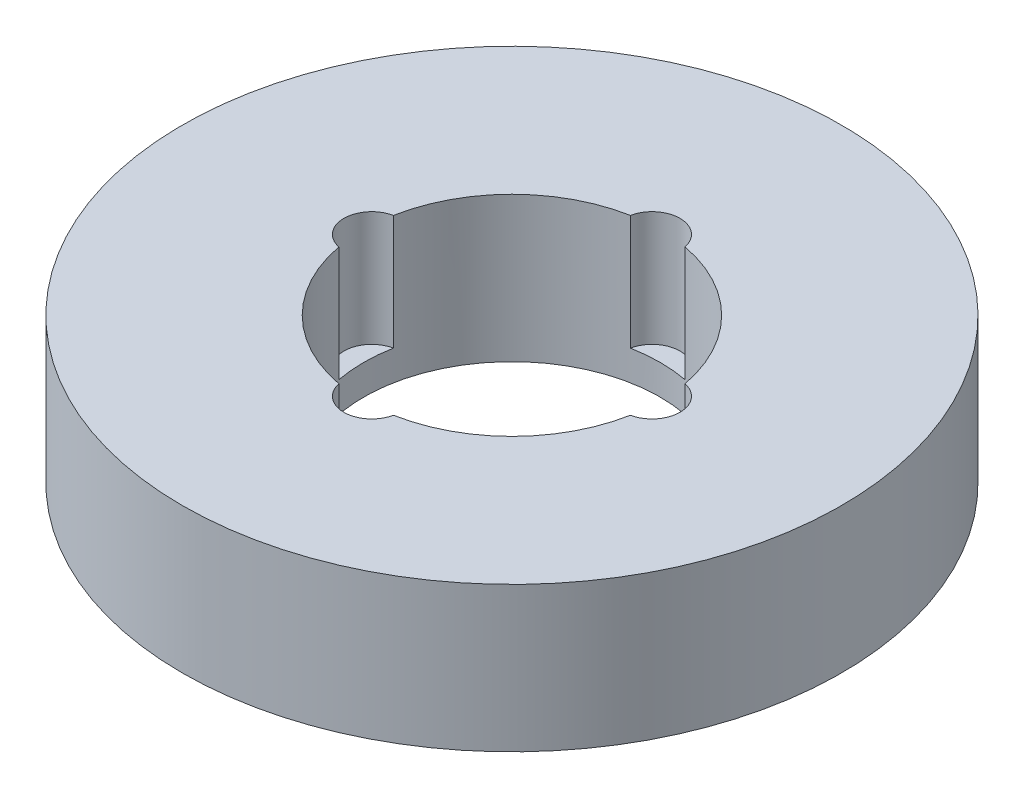
ISO-10303-21;
HEADER;
FILE_DESCRIPTION(('STEP AP214'),'2;1');
FILE_NAME('part.step','',(''),(''),'','','');
FILE_SCHEMA(('AUTOMOTIVE_DESIGN { 1 0 10303 214 1 1 1 1 }'));
ENDSEC;
DATA;
#1=APPLICATION_CONTEXT('core data for automotive mechanical design processes');
#2=APPLICATION_PROTOCOL_DEFINITION('international standard','automotive_design',2000,#1);
#3=PRODUCT_CONTEXT('',#1,'mechanical');
#4=PRODUCT('Part','Part','',(#3));
#5=PRODUCT_RELATED_PRODUCT_CATEGORY('part','',(#4));
#6=PRODUCT_DEFINITION_FORMATION('','',#4);
#7=PRODUCT_DEFINITION_CONTEXT('part definition',#1,'design');
#8=PRODUCT_DEFINITION('design','',#6,#7);
#9=PRODUCT_DEFINITION_SHAPE('','',#8);
#10=(LENGTH_UNIT() NAMED_UNIT(*) SI_UNIT(.MILLI.,.METRE.));
#11=(NAMED_UNIT(*) PLANE_ANGLE_UNIT() SI_UNIT($,.RADIAN.));
#12=(NAMED_UNIT(*) SI_UNIT($,.STERADIAN.) SOLID_ANGLE_UNIT());
#13=UNCERTAINTY_MEASURE_WITH_UNIT(LENGTH_MEASURE(1.E-05),#10,'distance_accuracy_value','');
#14=(GEOMETRIC_REPRESENTATION_CONTEXT(3) GLOBAL_UNCERTAINTY_ASSIGNED_CONTEXT((#13)) GLOBAL_UNIT_ASSIGNED_CONTEXT((#10,
#11,#12)) REPRESENTATION_CONTEXT('',''));
#15=CARTESIAN_POINT('',(0.,0.,0.));
#16=DIRECTION('',(0.,0.,1.));
#17=DIRECTION('',(1.,0.,0.));
#18=AXIS2_PLACEMENT_3D('',#15,#16,#17);
#19=CARTESIAN_POINT('',(0.,22.,0.));
#20=DIRECTION('',(0.,-1.,0.));
#21=DIRECTION('',(0.,0.,-1.));
#22=AXIS2_PLACEMENT_3D('',#19,#20,#21);
#23=CYLINDRICAL_SURFACE('',#22,50.);
#24=CARTESIAN_POINT('',(0.,22.,0.));
#25=DIRECTION('',(0.,1.,0.));
#26=DIRECTION('',(0.,0.,1.));
#27=AXIS2_PLACEMENT_3D('',#24,#25,#26);
#28=CIRCLE('',#27,50.);
#29=CARTESIAN_POINT('',(0.,22.,50.));
#30=VERTEX_POINT('',#29);
#31=EDGE_CURVE('E148',#30,#30,#28,.T.);
#32=ORIENTED_EDGE('',*,*,#31,.F.);
#33=EDGE_LOOP('',(#32));
#34=FACE_BOUND('',#33,.T.);
#35=CARTESIAN_POINT('',(0.,0.,0.));
#36=DIRECTION('',(0.,1.,0.));
#37=DIRECTION('',(0.,0.,1.));
#38=AXIS2_PLACEMENT_3D('',#35,#36,#37);
#39=CIRCLE('',#38,50.);
#40=CARTESIAN_POINT('',(0.,0.,50.));
#41=VERTEX_POINT('',#40);
#42=EDGE_CURVE('E139',#41,#41,#39,.T.);
#43=ORIENTED_EDGE('',*,*,#42,.T.);
#44=EDGE_LOOP('',(#43));
#45=FACE_BOUND('',#44,.T.);
#46=ADVANCED_FACE('F39',(#34,#45),#23,.T.);
#47=CARTESIAN_POINT('',(0.,22.,0.));
#48=DIRECTION('',(0.,1.,0.));
#49=DIRECTION('',(0.,0.,1.));
#50=AXIS2_PLACEMENT_3D('',#47,#48,#49);
#51=PLANE('',#50);
#52=CARTESIAN_POINT('',(0.,22.,21.2632696186375));
#53=DIRECTION('',(0.,1.,0.));
#54=DIRECTION('',(1.,0.,0.));
#55=AXIS2_PLACEMENT_3D('',#52,#53,#54);
#56=CIRCLE('',#55,4.22905657797358);
#57=CARTESIAN_POINT('',(-4.14231598885823,22.,22.1154068072113));
#58=VERTEX_POINT('',#57);
#59=CARTESIAN_POINT('',(4.14231598885839,22.,22.1154068072113));
#60=VERTEX_POINT('',#59);
#61=EDGE_CURVE('E175',#58,#60,#56,.T.);
#62=ORIENTED_EDGE('',*,*,#61,.F.);
#63=CARTESIAN_POINT('',(0.,22.,0.));
#64=DIRECTION('',(0.,1.,0.));
#65=DIRECTION('',(0.,0.,1.));
#66=AXIS2_PLACEMENT_3D('',#63,#64,#65);
#67=CIRCLE('',#66,22.5);
#68=CARTESIAN_POINT('',(-22.1154068072113,22.,4.14231598885831));
#69=VERTEX_POINT('',#68);
#70=EDGE_CURVE('E134',#69,#58,#67,.T.);
#71=ORIENTED_EDGE('',*,*,#70,.F.);
#72=CARTESIAN_POINT('',(-21.2632696186375,22.,0.));
#73=DIRECTION('',(0.,1.,0.));
#74=DIRECTION('',(0.,0.,1.));
#75=AXIS2_PLACEMENT_3D('',#72,#73,#74);
#76=CIRCLE('',#75,4.22905657797358);
#77=CARTESIAN_POINT('',(-22.1154068072113,22.,-4.14231598885831));
#78=VERTEX_POINT('',#77);
#79=EDGE_CURVE('E143',#78,#69,#76,.T.);
#80=ORIENTED_EDGE('',*,*,#79,.F.);
#81=CARTESIAN_POINT('',(-4.14231598885854,22.,-22.1154068072113));
#82=VERTEX_POINT('',#81);
#83=EDGE_CURVE('E123',#82,#78,#67,.T.);
#84=ORIENTED_EDGE('',*,*,#83,.F.);
#85=CARTESIAN_POINT('',(-2.22720927228789E-13,22.,-21.2632696186375));
#86=DIRECTION('',(0.,1.,0.));
#87=DIRECTION('',(-1.,0.,0.));
#88=AXIS2_PLACEMENT_3D('',#85,#86,#87);
#89=CIRCLE('',#88,4.22905657797358);
#90=CARTESIAN_POINT('',(4.14231598885808,22.,-22.1154068072114));
#91=VERTEX_POINT('',#90);
#92=EDGE_CURVE('E106',#91,#82,#89,.T.);
#93=ORIENTED_EDGE('',*,*,#92,.F.);
#94=CARTESIAN_POINT('',(22.1154068072113,22.,-4.14231598885831));
#95=VERTEX_POINT('',#94);
#96=EDGE_CURVE('E125',#95,#91,#67,.T.);
#97=ORIENTED_EDGE('',*,*,#96,.F.);
#98=CARTESIAN_POINT('',(21.2632696186375,22.,0.));
#99=DIRECTION('',(0.,1.,0.));
#100=DIRECTION('',(0.,0.,-1.));
#101=AXIS2_PLACEMENT_3D('',#98,#99,#100);
#102=CIRCLE('',#101,4.22905657797358);
#103=CARTESIAN_POINT('',(22.1154068072113,22.,4.14231598885831));
#104=VERTEX_POINT('',#103);
#105=EDGE_CURVE('E286',#104,#95,#102,.T.);
#106=ORIENTED_EDGE('',*,*,#105,.F.);
#107=EDGE_CURVE('E135',#60,#104,#67,.T.);
#108=ORIENTED_EDGE('',*,*,#107,.F.);
#109=EDGE_LOOP('',(#62,#71,#80,#84,#93,#97,#106,#108));
#110=FACE_BOUND('',#109,.T.);
#111=ORIENTED_EDGE('',*,*,#31,.T.);
#112=EDGE_LOOP('',(#111));
#113=FACE_BOUND('',#112,.T.);
#114=ADVANCED_FACE('F118',(#110,#113),#51,.T.);
#115=CARTESIAN_POINT('',(0.,0.,0.));
#116=DIRECTION('',(0.,1.,0.));
#117=DIRECTION('',(0.,0.,1.));
#118=AXIS2_PLACEMENT_3D('',#115,#116,#117);
#119=PLANE('',#118);
#120=CARTESIAN_POINT('',(0.,0.,0.));
#121=DIRECTION('',(0.,1.,0.));
#122=DIRECTION('',(0.,0.,1.));
#123=AXIS2_PLACEMENT_3D('',#120,#121,#122);
#124=CIRCLE('',#123,22.5);
#125=CARTESIAN_POINT('',(0.,0.,22.5));
#126=VERTEX_POINT('',#125);
#127=EDGE_CURVE('E136',#126,#126,#124,.T.);
#128=ORIENTED_EDGE('',*,*,#127,.T.);
#129=EDGE_LOOP('',(#128));
#130=FACE_BOUND('',#129,.T.);
#131=ORIENTED_EDGE('',*,*,#42,.F.);
#132=EDGE_LOOP('',(#131));
#133=FACE_BOUND('',#132,.T.);
#134=ADVANCED_FACE('F187',(#130,#133),#119,.F.);
#135=CARTESIAN_POINT('',(0.,22.,0.));
#136=DIRECTION('',(0.,-1.,0.));
#137=DIRECTION('',(0.,0.,-1.));
#138=AXIS2_PLACEMENT_3D('',#135,#136,#137);
#139=CYLINDRICAL_SURFACE('',#138,22.5);
#140=DIRECTION('',(0.,1.,0.));
#141=VECTOR('',#140,1.);
#142=CARTESIAN_POINT('',(-4.14231598885823,13.2809377697363,22.1154068072113));
#143=LINE('',#142,#141);
#144=CARTESIAN_POINT('',(-4.14231598885823,4.56187553947257,22.1154068072113));
#145=VERTEX_POINT('',#144);
#146=EDGE_CURVE('E11',#145,#58,#143,.T.);
#147=ORIENTED_EDGE('',*,*,#146,.F.);
#148=CARTESIAN_POINT('',(0.,4.56187553947257,0.));
#149=DIRECTION('',(0.,1.,0.));
#150=DIRECTION('',(0.,0.,1.));
#151=AXIS2_PLACEMENT_3D('',#148,#149,#150);
#152=CIRCLE('',#151,22.5);
#153=CARTESIAN_POINT('',(4.14231598885839,4.56187553947257,22.1154068072113));
#154=VERTEX_POINT('',#153);
#155=EDGE_CURVE('E170',#145,#154,#152,.T.);
#156=ORIENTED_EDGE('',*,*,#155,.T.);
#157=DIRECTION('',(0.,1.,0.));
#158=VECTOR('',#157,1.);
#159=CARTESIAN_POINT('',(4.14231598885839,13.2809377697363,22.1154068072113));
#160=LINE('',#159,#158);
#161=EDGE_CURVE('E46',#60,#154,#160,.F.);
#162=ORIENTED_EDGE('',*,*,#161,.F.);
#163=ORIENTED_EDGE('',*,*,#107,.T.);
#164=DIRECTION('',(0.,1.,0.));
#165=VECTOR('',#164,1.);
#166=CARTESIAN_POINT('',(22.1154068072113,13.2809377697363,4.14231598885831));
#167=LINE('',#166,#165);
#168=CARTESIAN_POINT('',(22.1154068072113,4.56187553947257,4.14231598885831));
#169=VERTEX_POINT('',#168);
#170=EDGE_CURVE('E164',#169,#104,#167,.T.);
#171=ORIENTED_EDGE('',*,*,#170,.F.);
#172=CARTESIAN_POINT('',(0.,4.56187553947257,0.));
#173=DIRECTION('',(0.,1.,0.));
#174=DIRECTION('',(0.,0.,1.));
#175=AXIS2_PLACEMENT_3D('',#172,#173,#174);
#176=CIRCLE('',#175,22.5);
#177=CARTESIAN_POINT('',(22.1154068072113,4.56187553947257,-4.14231598885831));
#178=VERTEX_POINT('',#177);
#179=EDGE_CURVE('E115',#169,#178,#176,.T.);
#180=ORIENTED_EDGE('',*,*,#179,.T.);
#181=DIRECTION('',(0.,1.,0.));
#182=VECTOR('',#181,1.);
#183=CARTESIAN_POINT('',(22.1154068072113,13.2809377697363,-4.14231598885831));
#184=LINE('',#183,#182);
#185=EDGE_CURVE('E131',#95,#178,#184,.F.);
#186=ORIENTED_EDGE('',*,*,#185,.F.);
#187=ORIENTED_EDGE('',*,*,#96,.T.);
#188=DIRECTION('',(0.,1.,0.));
#189=VECTOR('',#188,1.);
#190=CARTESIAN_POINT('',(4.14231598885808,13.2809377697363,-22.1154068072114));
#191=LINE('',#190,#189);
#192=CARTESIAN_POINT('',(4.14231598885808,4.56187553947257,-22.1154068072114));
#193=VERTEX_POINT('',#192);
#194=EDGE_CURVE('E105',#193,#91,#191,.T.);
#195=ORIENTED_EDGE('',*,*,#194,.F.);
#196=CARTESIAN_POINT('',(0.,4.56187553947257,0.));
#197=DIRECTION('',(0.,1.,0.));
#198=DIRECTION('',(0.,0.,1.));
#199=AXIS2_PLACEMENT_3D('',#196,#197,#198);
#200=CIRCLE('',#199,22.5);
#201=CARTESIAN_POINT('',(-4.14231598885854,4.56187553947257,-22.1154068072113));
#202=VERTEX_POINT('',#201);
#203=EDGE_CURVE('E159',#193,#202,#200,.T.);
#204=ORIENTED_EDGE('',*,*,#203,.T.);
#205=DIRECTION('',(0.,1.,0.));
#206=VECTOR('',#205,1.);
#207=CARTESIAN_POINT('',(-4.14231598885854,13.2809377697363,-22.1154068072113));
#208=LINE('',#207,#206);
#209=EDGE_CURVE('E114',#82,#202,#208,.F.);
#210=ORIENTED_EDGE('',*,*,#209,.F.);
#211=ORIENTED_EDGE('',*,*,#83,.T.);
#212=DIRECTION('',(0.,1.,0.));
#213=VECTOR('',#212,1.);
#214=CARTESIAN_POINT('',(-22.1154068072113,13.2809377697363,-4.14231598885831));
#215=LINE('',#214,#213);
#216=CARTESIAN_POINT('',(-22.1154068072113,4.56187553947257,-4.14231598885831));
#217=VERTEX_POINT('',#216);
#218=EDGE_CURVE('E160',#217,#78,#215,.T.);
#219=ORIENTED_EDGE('',*,*,#218,.F.);
#220=CARTESIAN_POINT('',(0.,4.56187553947257,0.));
#221=DIRECTION('',(0.,1.,0.));
#222=DIRECTION('',(0.,0.,1.));
#223=AXIS2_PLACEMENT_3D('',#220,#221,#222);
#224=CIRCLE('',#223,22.5);
#225=CARTESIAN_POINT('',(-22.1154068072113,4.56187553947257,4.14231598885831));
#226=VERTEX_POINT('',#225);
#227=EDGE_CURVE('E149',#217,#226,#224,.T.);
#228=ORIENTED_EDGE('',*,*,#227,.T.);
#229=DIRECTION('',(0.,1.,0.));
#230=VECTOR('',#229,1.);
#231=CARTESIAN_POINT('',(-22.1154068072113,13.2809377697363,4.14231598885831));
#232=LINE('',#231,#230);
#233=EDGE_CURVE('E152',#69,#226,#232,.F.);
#234=ORIENTED_EDGE('',*,*,#233,.F.);
#235=ORIENTED_EDGE('',*,*,#70,.T.);
#236=EDGE_LOOP('',(#147,#156,#162,#163,#171,#180,#186,#187,#195,#204,#210,#211,#219,#228,#234,#235));
#237=FACE_BOUND('',#236,.T.);
#238=ORIENTED_EDGE('',*,*,#127,.F.);
#239=EDGE_LOOP('',(#238));
#240=FACE_BOUND('',#239,.T.);
#241=ADVANCED_FACE('F126',(#237,#240),#139,.F.);
#242=CARTESIAN_POINT('',(-21.2632696186375,4.56187553947257,0.));
#243=DIRECTION('',(0.,1.,0.));
#244=DIRECTION('',(0.,0.,1.));
#245=AXIS2_PLACEMENT_3D('',#242,#243,#244);
#246=CYLINDRICAL_SURFACE('',#245,4.22905657797358);
#247=ORIENTED_EDGE('',*,*,#218,.T.);
#248=ORIENTED_EDGE('',*,*,#79,.T.);
#249=ORIENTED_EDGE('',*,*,#233,.T.);
#250=CARTESIAN_POINT('',(-21.2632696186375,4.56187553947257,0.));
#251=DIRECTION('',(0.,1.,0.));
#252=DIRECTION('',(0.,0.,1.));
#253=AXIS2_PLACEMENT_3D('',#250,#251,#252);
#254=CIRCLE('',#253,4.22905657797358);
#255=EDGE_CURVE('E144',#217,#226,#254,.T.);
#256=ORIENTED_EDGE('',*,*,#255,.F.);
#257=EDGE_LOOP('',(#247,#248,#249,#256));
#258=FACE_BOUND('',#257,.T.);
#259=ADVANCED_FACE('F200',(#258),#246,.F.);
#260=CARTESIAN_POINT('',(-21.2632696186375,4.56187553947257,0.));
#261=DIRECTION('',(0.,1.,0.));
#262=DIRECTION('',(0.,0.,1.));
#263=AXIS2_PLACEMENT_3D('',#260,#261,#262);
#264=PLANE('',#263);
#265=ORIENTED_EDGE('',*,*,#255,.T.);
#266=ORIENTED_EDGE('',*,*,#227,.F.);
#267=EDGE_LOOP('',(#265,#266));
#268=FACE_BOUND('',#267,.T.);
#269=ADVANCED_FACE('F201',(#268),#264,.T.);
#270=CARTESIAN_POINT('',(-2.22720927228789E-13,4.56187553947257,-21.2632696186375));
#271=DIRECTION('',(0.,1.,0.));
#272=DIRECTION('',(0.,0.,1.));
#273=AXIS2_PLACEMENT_3D('',#270,#271,#272);
#274=CYLINDRICAL_SURFACE('',#273,4.22905657797358);
#275=ORIENTED_EDGE('',*,*,#194,.T.);
#276=ORIENTED_EDGE('',*,*,#92,.T.);
#277=ORIENTED_EDGE('',*,*,#209,.T.);
#278=CARTESIAN_POINT('',(-2.22720927228789E-13,4.56187553947257,-21.2632696186375));
#279=DIRECTION('',(0.,1.,0.));
#280=DIRECTION('',(-1.,0.,0.));
#281=AXIS2_PLACEMENT_3D('',#278,#279,#280);
#282=CIRCLE('',#281,4.22905657797358);
#283=EDGE_CURVE('E107',#193,#202,#282,.T.);
#284=ORIENTED_EDGE('',*,*,#283,.F.);
#285=EDGE_LOOP('',(#275,#276,#277,#284));
#286=FACE_BOUND('',#285,.T.);
#287=ADVANCED_FACE('F102',(#286),#274,.F.);
#288=CARTESIAN_POINT('',(-2.22720927228789E-13,4.56187553947257,-21.2632696186375));
#289=DIRECTION('',(0.,1.,0.));
#290=DIRECTION('',(-1.,0.,0.));
#291=AXIS2_PLACEMENT_3D('',#288,#289,#290);
#292=PLANE('',#291);
#293=ORIENTED_EDGE('',*,*,#283,.T.);
#294=ORIENTED_EDGE('',*,*,#203,.F.);
#295=EDGE_LOOP('',(#293,#294));
#296=FACE_BOUND('',#295,.T.);
#297=ADVANCED_FACE('F209',(#296),#292,.T.);
#298=CARTESIAN_POINT('',(21.2632696186375,4.56187553947257,0.));
#299=DIRECTION('',(0.,1.,0.));
#300=DIRECTION('',(0.,0.,1.));
#301=AXIS2_PLACEMENT_3D('',#298,#299,#300);
#302=CYLINDRICAL_SURFACE('',#301,4.22905657797358);
#303=ORIENTED_EDGE('',*,*,#170,.T.);
#304=ORIENTED_EDGE('',*,*,#105,.T.);
#305=ORIENTED_EDGE('',*,*,#185,.T.);
#306=CARTESIAN_POINT('',(21.2632696186375,4.56187553947257,0.));
#307=DIRECTION('',(0.,1.,0.));
#308=DIRECTION('',(0.,0.,-1.));
#309=AXIS2_PLACEMENT_3D('',#306,#307,#308);
#310=CIRCLE('',#309,4.22905657797358);
#311=EDGE_CURVE('E56',#169,#178,#310,.T.);
#312=ORIENTED_EDGE('',*,*,#311,.F.);
#313=EDGE_LOOP('',(#303,#304,#305,#312));
#314=FACE_BOUND('',#313,.T.);
#315=ADVANCED_FACE('F213',(#314),#302,.F.);
#316=CARTESIAN_POINT('',(21.2632696186375,4.56187553947257,0.));
#317=DIRECTION('',(0.,1.,0.));
#318=DIRECTION('',(0.,0.,-1.));
#319=AXIS2_PLACEMENT_3D('',#316,#317,#318);
#320=PLANE('',#319);
#321=ORIENTED_EDGE('',*,*,#311,.T.);
#322=ORIENTED_EDGE('',*,*,#179,.F.);
#323=EDGE_LOOP('',(#321,#322));
#324=FACE_BOUND('',#323,.T.);
#325=ADVANCED_FACE('F179',(#324),#320,.T.);
#326=CARTESIAN_POINT('',(0.,4.56187553947257,21.2632696186375));
#327=DIRECTION('',(0.,1.,0.));
#328=DIRECTION('',(0.,0.,1.));
#329=AXIS2_PLACEMENT_3D('',#326,#327,#328);
#330=CYLINDRICAL_SURFACE('',#329,4.22905657797358);
#331=ORIENTED_EDGE('',*,*,#146,.T.);
#332=ORIENTED_EDGE('',*,*,#61,.T.);
#333=ORIENTED_EDGE('',*,*,#161,.T.);
#334=CARTESIAN_POINT('',(0.,4.56187553947257,21.2632696186375));
#335=DIRECTION('',(0.,1.,0.));
#336=DIRECTION('',(1.,0.,0.));
#337=AXIS2_PLACEMENT_3D('',#334,#335,#336);
#338=CIRCLE('',#337,4.22905657797358);
#339=EDGE_CURVE('E55',#145,#154,#338,.T.);
#340=ORIENTED_EDGE('',*,*,#339,.F.);
#341=EDGE_LOOP('',(#331,#332,#333,#340));
#342=FACE_BOUND('',#341,.T.);
#343=ADVANCED_FACE('F171',(#342),#330,.F.);
#344=CARTESIAN_POINT('',(0.,4.56187553947257,21.2632696186375));
#345=DIRECTION('',(0.,1.,0.));
#346=DIRECTION('',(1.,0.,0.));
#347=AXIS2_PLACEMENT_3D('',#344,#345,#346);
#348=PLANE('',#347);
#349=ORIENTED_EDGE('',*,*,#339,.T.);
#350=ORIENTED_EDGE('',*,*,#155,.F.);
#351=EDGE_LOOP('',(#349,#350));
#352=FACE_BOUND('',#351,.T.);
#353=ADVANCED_FACE('F173',(#352),#348,.T.);
#354=CLOSED_SHELL('',(#46,#114,#134,#241,#259,#269,#287,#297,#315,#325,#343,#353));
#355=MANIFOLD_SOLID_BREP('B2',#354);
#356=ADVANCED_BREP_SHAPE_REPRESENTATION('',(#18,#355),#14);
#357=SHAPE_DEFINITION_REPRESENTATION(#9,#356);
ENDSEC;
END-ISO-10303-21;
